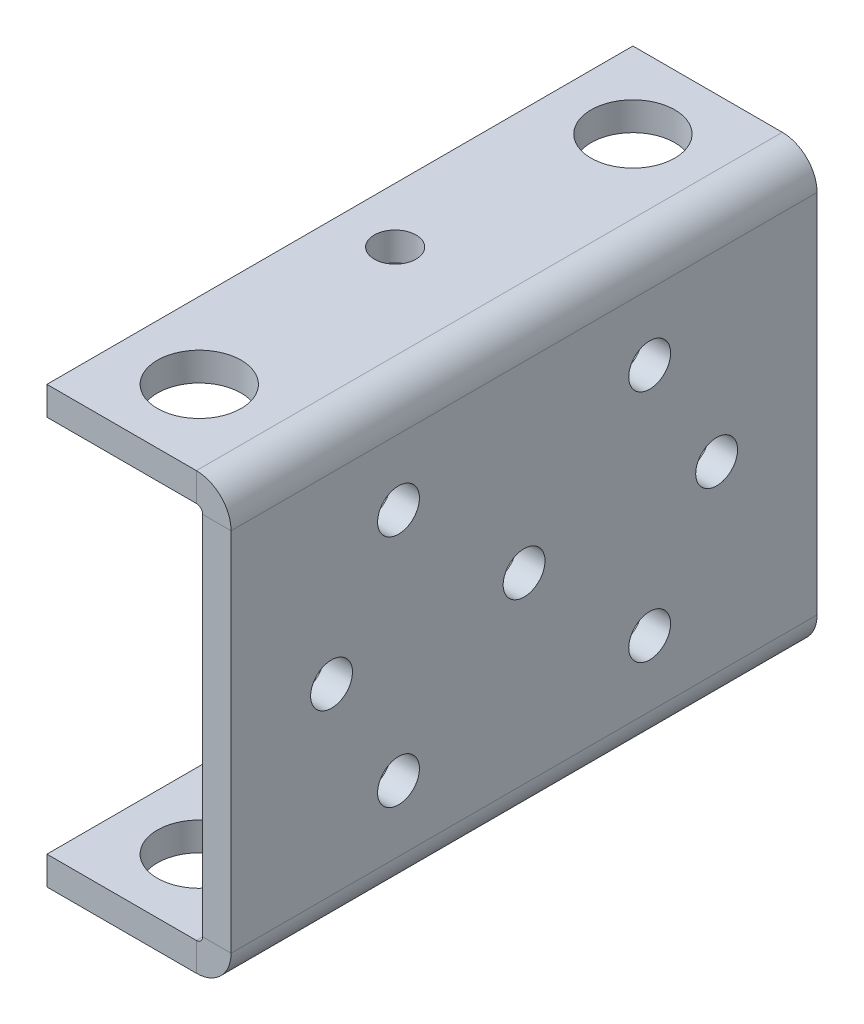
ISO-10303-21;
HEADER;
FILE_DESCRIPTION(('STEP AP214'),'2;1');
FILE_NAME('part.step','',(''),(''),'','','');
FILE_SCHEMA(('AUTOMOTIVE_DESIGN { 1 0 10303 214 1 1 1 1 }'));
ENDSEC;
DATA;
#1=APPLICATION_CONTEXT('core data for automotive mechanical design processes');
#2=APPLICATION_PROTOCOL_DEFINITION('international standard','automotive_design',2000,#1);
#3=PRODUCT_CONTEXT('',#1,'mechanical');
#4=PRODUCT('Part','Part','',(#3));
#5=PRODUCT_RELATED_PRODUCT_CATEGORY('part','',(#4));
#6=PRODUCT_DEFINITION_FORMATION('','',#4);
#7=PRODUCT_DEFINITION_CONTEXT('part definition',#1,'design');
#8=PRODUCT_DEFINITION('design','',#6,#7);
#9=PRODUCT_DEFINITION_SHAPE('','',#8);
#10=(LENGTH_UNIT() NAMED_UNIT(*) SI_UNIT(.MILLI.,.METRE.));
#11=(NAMED_UNIT(*) PLANE_ANGLE_UNIT() SI_UNIT($,.RADIAN.));
#12=(NAMED_UNIT(*) SI_UNIT($,.STERADIAN.) SOLID_ANGLE_UNIT());
#13=UNCERTAINTY_MEASURE_WITH_UNIT(LENGTH_MEASURE(1.E-05),#10,'distance_accuracy_value','');
#14=(GEOMETRIC_REPRESENTATION_CONTEXT(3) GLOBAL_UNCERTAINTY_ASSIGNED_CONTEXT((#13)) GLOBAL_UNIT_ASSIGNED_CONTEXT((#10,
#11,#12)) REPRESENTATION_CONTEXT('',''));
#15=CARTESIAN_POINT('',(0.,0.,0.));
#16=DIRECTION('',(0.,0.,1.));
#17=DIRECTION('',(1.,0.,0.));
#18=AXIS2_PLACEMENT_3D('',#15,#16,#17);
#19=CARTESIAN_POINT('',(-3.40000000000001,26.,70.));
#20=DIRECTION('',(1.,0.,0.));
#21=DIRECTION('',(0.,1.,0.));
#22=AXIS2_PLACEMENT_3D('',#19,#20,#21);
#23=PLANE('',#22);
#24=CARTESIAN_POINT('',(-3.4,-3.21964792834985E-13,34.9999999999981));
#25=DIRECTION('',(-1.,0.,0.));
#26=DIRECTION('',(0.,-1.,0.));
#27=AXIS2_PLACEMENT_3D('',#24,#25,#26);
#28=CIRCLE('',#27,2.50000000000195);
#29=CARTESIAN_POINT('',(-3.4,-2.50000000000228,34.9999999999981));
#30=VERTEX_POINT('',#29);
#31=EDGE_CURVE('E387',#30,#30,#28,.T.);
#32=ORIENTED_EDGE('',*,*,#31,.F.);
#33=EDGE_LOOP('',(#32));
#34=FACE_BOUND('',#33,.T.);
#35=CARTESIAN_POINT('',(-3.40000000000001,13.9999999999997,49.9999999999964));
#36=DIRECTION('',(-1.,0.,0.));
#37=DIRECTION('',(0.,-1.,0.));
#38=AXIS2_PLACEMENT_3D('',#35,#36,#37);
#39=CIRCLE('',#38,2.4999999999999);
#40=CARTESIAN_POINT('',(-3.4,11.4999999999998,49.9999999999964));
#41=VERTEX_POINT('',#40);
#42=EDGE_CURVE('E391',#41,#41,#39,.T.);
#43=ORIENTED_EDGE('',*,*,#42,.F.);
#44=EDGE_LOOP('',(#43));
#45=FACE_BOUND('',#44,.T.);
#46=CARTESIAN_POINT('',(-3.4,-3.20230069359008E-13,57.9999999999981));
#47=DIRECTION('',(-1.,0.,0.));
#48=DIRECTION('',(0.,-1.,0.));
#49=AXIS2_PLACEMENT_3D('',#46,#47,#48);
#50=CIRCLE('',#49,2.50000000000106);
#51=CARTESIAN_POINT('',(-3.4,-2.50000000000138,57.9999999999981));
#52=VERTEX_POINT('',#51);
#53=EDGE_CURVE('E395',#52,#52,#50,.T.);
#54=ORIENTED_EDGE('',*,*,#53,.F.);
#55=EDGE_LOOP('',(#54));
#56=FACE_BOUND('',#55,.T.);
#57=CARTESIAN_POINT('',(-3.4,-14.0000000000003,19.9999999999997));
#58=DIRECTION('',(-1.,0.,0.));
#59=DIRECTION('',(0.,-1.,0.));
#60=AXIS2_PLACEMENT_3D('',#57,#58,#59);
#61=CIRCLE('',#60,2.49999999999998);
#62=CARTESIAN_POINT('',(-3.4,-16.5000000000003,19.9999999999997));
#63=VERTEX_POINT('',#62);
#64=EDGE_CURVE('E398',#63,#63,#61,.T.);
#65=ORIENTED_EDGE('',*,*,#64,.F.);
#66=EDGE_LOOP('',(#65));
#67=FACE_BOUND('',#66,.T.);
#68=DIRECTION('',(0.,0.,1.));
#69=VECTOR('',#68,1.);
#70=CARTESIAN_POINT('',(-3.39999999999999,-21.85,70.));
#71=LINE('',#70,#69);
#72=CARTESIAN_POINT('',(-3.39999999999999,-21.85,70.));
#73=VERTEX_POINT('',#72);
#74=CARTESIAN_POINT('',(-3.39999999999999,-21.85,0.));
#75=VERTEX_POINT('',#74);
#76=EDGE_CURVE('E222',#73,#75,#71,.F.);
#77=ORIENTED_EDGE('',*,*,#76,.F.);
#78=DIRECTION('',(0.,-1.,0.));
#79=VECTOR('',#78,1.);
#80=CARTESIAN_POINT('',(-3.40000000000001,26.,70.));
#81=LINE('',#80,#79);
#82=CARTESIAN_POINT('',(-3.4,21.85,70.));
#83=VERTEX_POINT('',#82);
#84=EDGE_CURVE('E86',#83,#73,#81,.T.);
#85=ORIENTED_EDGE('',*,*,#84,.F.);
#86=DIRECTION('',(0.,0.,-1.));
#87=VECTOR('',#86,1.);
#88=CARTESIAN_POINT('',(-3.4,21.85,0.));
#89=LINE('',#88,#87);
#90=CARTESIAN_POINT('',(-3.4,21.85,0.));
#91=VERTEX_POINT('',#90);
#92=EDGE_CURVE('E273',#91,#83,#89,.F.);
#93=ORIENTED_EDGE('',*,*,#92,.F.);
#94=DIRECTION('',(0.,-1.,0.));
#95=VECTOR('',#94,1.);
#96=CARTESIAN_POINT('',(-3.40000000000001,26.,0.));
#97=LINE('',#96,#95);
#98=EDGE_CURVE('E279',#91,#75,#97,.T.);
#99=ORIENTED_EDGE('',*,*,#98,.T.);
#100=EDGE_LOOP('',(#77,#85,#93,#99));
#101=FACE_BOUND('',#100,.T.);
#102=CARTESIAN_POINT('',(-3.4,-3.23046756997047E-13,11.9999999999981));
#103=DIRECTION('',(1.,0.,0.));
#104=DIRECTION('',(0.,1.,0.));
#105=AXIS2_PLACEMENT_3D('',#102,#103,#104);
#106=CIRCLE('',#105,2.50000000000106);
#107=CARTESIAN_POINT('',(-3.4,2.50000000000074,11.9999999999981));
#108=VERTEX_POINT('',#107);
#109=EDGE_CURVE('E688',#108,#108,#106,.T.);
#110=ORIENTED_EDGE('',*,*,#109,.T.);
#111=EDGE_LOOP('',(#110));
#112=FACE_BOUND('',#111,.T.);
#113=CARTESIAN_POINT('',(-3.4,-14.0000000000003,49.9999999999964));
#114=DIRECTION('',(-1.,0.,0.));
#115=DIRECTION('',(0.,-1.,0.));
#116=AXIS2_PLACEMENT_3D('',#113,#114,#115);
#117=CIRCLE('',#116,2.5);
#118=CARTESIAN_POINT('',(-3.4,-16.5000000000003,49.9999999999964));
#119=VERTEX_POINT('',#118);
#120=EDGE_CURVE('E401',#119,#119,#117,.F.);
#121=ORIENTED_EDGE('',*,*,#120,.T.);
#122=EDGE_LOOP('',(#121));
#123=FACE_BOUND('',#122,.T.);
#124=CARTESIAN_POINT('',(-3.40000000000001,13.9999999999997,19.9999999999997));
#125=DIRECTION('',(1.,0.,0.));
#126=DIRECTION('',(0.,1.,0.));
#127=AXIS2_PLACEMENT_3D('',#124,#125,#126);
#128=CIRCLE('',#127,2.5);
#129=CARTESIAN_POINT('',(-3.40000000000001,16.4999999999997,19.9999999999997));
#130=VERTEX_POINT('',#129);
#131=EDGE_CURVE('E678',#130,#130,#128,.T.);
#132=ORIENTED_EDGE('',*,*,#131,.T.);
#133=EDGE_LOOP('',(#132));
#134=FACE_BOUND('',#133,.T.);
#135=ADVANCED_FACE('F78',(#34,#45,#56,#67,#101,#112,#123,#134),#23,.F.);
#136=CARTESIAN_POINT('',(0.,26.,70.));
#137=DIRECTION('',(1.,0.,0.));
#138=DIRECTION('',(0.,1.,0.));
#139=AXIS2_PLACEMENT_3D('',#136,#137,#138);
#140=PLANE('',#139);
#141=CARTESIAN_POINT('',(0.,-3.20923843055709E-13,34.9999999999981));
#142=DIRECTION('',(-1.,0.,0.));
#143=DIRECTION('',(0.,-1.,0.));
#144=AXIS2_PLACEMENT_3D('',#141,#142,#143);
#145=CIRCLE('',#144,2.50000000000195);
#146=CARTESIAN_POINT('',(0.,-2.50000000000228,34.9999999999981));
#147=VERTEX_POINT('',#146);
#148=EDGE_CURVE('E668',#147,#147,#145,.T.);
#149=ORIENTED_EDGE('',*,*,#148,.T.);
#150=EDGE_LOOP('',(#149));
#151=FACE_BOUND('',#150,.T.);
#152=CARTESIAN_POINT('',(0.,13.9999999999997,49.9999999999964));
#153=DIRECTION('',(-1.,0.,0.));
#154=DIRECTION('',(0.,-1.,0.));
#155=AXIS2_PLACEMENT_3D('',#152,#153,#154);
#156=CIRCLE('',#155,2.4999999999999);
#157=CARTESIAN_POINT('',(0.,11.4999999999998,49.9999999999964));
#158=VERTEX_POINT('',#157);
#159=EDGE_CURVE('E669',#158,#158,#156,.T.);
#160=ORIENTED_EDGE('',*,*,#159,.T.);
#161=EDGE_LOOP('',(#160));
#162=FACE_BOUND('',#161,.T.);
#163=CARTESIAN_POINT('',(0.,-14.0000000000003,49.9999999999964));
#164=DIRECTION('',(-1.,0.,0.));
#165=DIRECTION('',(0.,-1.,0.));
#166=AXIS2_PLACEMENT_3D('',#163,#164,#165);
#167=CIRCLE('',#166,2.5);
#168=CARTESIAN_POINT('',(0.,-16.5000000000003,49.9999999999964));
#169=VERTEX_POINT('',#168);
#170=EDGE_CURVE('E407',#169,#169,#167,.F.);
#171=ORIENTED_EDGE('',*,*,#170,.F.);
#172=EDGE_LOOP('',(#171));
#173=FACE_BOUND('',#172,.T.);
#174=CARTESIAN_POINT('',(0.,-3.19189119579732E-13,57.9999999999981));
#175=DIRECTION('',(-1.,0.,0.));
#176=DIRECTION('',(0.,-1.,0.));
#177=AXIS2_PLACEMENT_3D('',#174,#175,#176);
#178=CIRCLE('',#177,2.50000000000106);
#179=CARTESIAN_POINT('',(0.,-2.50000000000138,57.9999999999981));
#180=VERTEX_POINT('',#179);
#181=EDGE_CURVE('E691',#180,#180,#178,.T.);
#182=ORIENTED_EDGE('',*,*,#181,.T.);
#183=EDGE_LOOP('',(#182));
#184=FACE_BOUND('',#183,.T.);
#185=DIRECTION('',(0.,-1.,0.));
#186=VECTOR('',#185,1.);
#187=CARTESIAN_POINT('',(0.,26.,70.));
#188=LINE('',#187,#186);
#189=CARTESIAN_POINT('',(0.,21.85,70.));
#190=VERTEX_POINT('',#189);
#191=CARTESIAN_POINT('',(0.,-21.85,70.));
#192=VERTEX_POINT('',#191);
#193=EDGE_CURVE('E13',#190,#192,#188,.T.);
#194=ORIENTED_EDGE('',*,*,#193,.T.);
#195=DIRECTION('',(0.,0.,1.));
#196=VECTOR('',#195,1.);
#197=CARTESIAN_POINT('',(0.,-21.85,70.));
#198=LINE('',#197,#196);
#199=CARTESIAN_POINT('',(0.,-21.85,0.));
#200=VERTEX_POINT('',#199);
#201=EDGE_CURVE('E211',#192,#200,#198,.F.);
#202=ORIENTED_EDGE('',*,*,#201,.T.);
#203=DIRECTION('',(0.,-1.,0.));
#204=VECTOR('',#203,1.);
#205=CARTESIAN_POINT('',(0.,26.,0.));
#206=LINE('',#205,#204);
#207=CARTESIAN_POINT('',(0.,21.85,0.));
#208=VERTEX_POINT('',#207);
#209=EDGE_CURVE('E283',#208,#200,#206,.T.);
#210=ORIENTED_EDGE('',*,*,#209,.F.);
#211=DIRECTION('',(0.,0.,-1.));
#212=VECTOR('',#211,1.);
#213=CARTESIAN_POINT('',(0.,21.85,0.));
#214=LINE('',#213,#212);
#215=EDGE_CURVE('E262',#208,#190,#214,.F.);
#216=ORIENTED_EDGE('',*,*,#215,.T.);
#217=EDGE_LOOP('',(#194,#202,#210,#216));
#218=FACE_BOUND('',#217,.T.);
#219=CARTESIAN_POINT('',(0.,-14.0000000000003,19.9999999999997));
#220=DIRECTION('',(-1.,0.,0.));
#221=DIRECTION('',(0.,-1.,0.));
#222=AXIS2_PLACEMENT_3D('',#219,#220,#221);
#223=CIRCLE('',#222,2.49999999999998);
#224=CARTESIAN_POINT('',(0.,-16.5000000000003,19.9999999999997));
#225=VERTEX_POINT('',#224);
#226=EDGE_CURVE('E400',#225,#225,#223,.T.);
#227=ORIENTED_EDGE('',*,*,#226,.T.);
#228=EDGE_LOOP('',(#227));
#229=FACE_BOUND('',#228,.T.);
#230=CARTESIAN_POINT('',(0.,-3.22005807217771E-13,11.9999999999981));
#231=DIRECTION('',(1.,0.,0.));
#232=DIRECTION('',(0.,1.,0.));
#233=AXIS2_PLACEMENT_3D('',#230,#231,#232);
#234=CIRCLE('',#233,2.50000000000106);
#235=CARTESIAN_POINT('',(0.,2.50000000000074,11.9999999999981));
#236=VERTEX_POINT('',#235);
#237=EDGE_CURVE('E685',#236,#236,#234,.T.);
#238=ORIENTED_EDGE('',*,*,#237,.F.);
#239=EDGE_LOOP('',(#238));
#240=FACE_BOUND('',#239,.T.);
#241=CARTESIAN_POINT('',(0.,13.9999999999997,19.9999999999997));
#242=DIRECTION('',(1.,0.,0.));
#243=DIRECTION('',(0.,1.,0.));
#244=AXIS2_PLACEMENT_3D('',#241,#242,#243);
#245=CIRCLE('',#244,2.5);
#246=CARTESIAN_POINT('',(0.,16.4999999999997,19.9999999999997));
#247=VERTEX_POINT('',#246);
#248=EDGE_CURVE('E680',#247,#247,#245,.T.);
#249=ORIENTED_EDGE('',*,*,#248,.F.);
#250=EDGE_LOOP('',(#249));
#251=FACE_BOUND('',#250,.T.);
#252=ADVANCED_FACE('F328',(#151,#162,#173,#184,#218,#229,#240,#251),#140,.T.);
#253=CARTESIAN_POINT('',(0.,0.,70.));
#254=DIRECTION('',(0.,0.,-1.));
#255=DIRECTION('',(-1.,0.,0.));
#256=AXIS2_PLACEMENT_3D('',#253,#254,#255);
#257=PLANE('',#256);
#258=DIRECTION('',(1.,0.,0.));
#259=VECTOR('',#258,1.);
#260=CARTESIAN_POINT('',(-3.39999999999999,-21.85,70.));
#261=LINE('',#260,#259);
#262=EDGE_CURVE('E216',#73,#192,#261,.T.);
#263=ORIENTED_EDGE('',*,*,#262,.T.);
#264=ORIENTED_EDGE('',*,*,#193,.F.);
#265=DIRECTION('',(1.,0.,0.));
#266=VECTOR('',#265,1.);
#267=CARTESIAN_POINT('',(-3.4,21.85,70.));
#268=LINE('',#267,#266);
#269=EDGE_CURVE('E277',#83,#190,#268,.T.);
#270=ORIENTED_EDGE('',*,*,#269,.F.);
#271=ORIENTED_EDGE('',*,*,#84,.T.);
#272=EDGE_LOOP('',(#263,#264,#270,#271));
#273=FACE_BOUND('',#272,.T.);
#274=ADVANCED_FACE('F324',(#273),#257,.F.);
#275=CARTESIAN_POINT('',(0.,0.,0.));
#276=DIRECTION('',(0.,0.,-1.));
#277=DIRECTION('',(-1.,0.,0.));
#278=AXIS2_PLACEMENT_3D('',#275,#276,#277);
#279=PLANE('',#278);
#280=DIRECTION('',(1.,0.,0.));
#281=VECTOR('',#280,1.);
#282=CARTESIAN_POINT('',(-3.39999999999999,-21.85,0.));
#283=LINE('',#282,#281);
#284=EDGE_CURVE('E227',#75,#200,#283,.T.);
#285=ORIENTED_EDGE('',*,*,#284,.F.);
#286=ORIENTED_EDGE('',*,*,#98,.F.);
#287=DIRECTION('',(1.,0.,0.));
#288=VECTOR('',#287,1.);
#289=CARTESIAN_POINT('',(-3.4,21.85,0.));
#290=LINE('',#289,#288);
#291=EDGE_CURVE('E267',#91,#208,#290,.T.);
#292=ORIENTED_EDGE('',*,*,#291,.T.);
#293=ORIENTED_EDGE('',*,*,#209,.T.);
#294=EDGE_LOOP('',(#285,#286,#292,#293));
#295=FACE_BOUND('',#294,.T.);
#296=ADVANCED_FACE('F340',(#295),#279,.T.);
#297=CARTESIAN_POINT('',(-4.15,21.85,70.));
#298=DIRECTION('',(0.,0.,1.));
#299=DIRECTION('',(1.,0.,0.));
#300=AXIS2_PLACEMENT_3D('',#297,#298,#299);
#301=PLANE('',#300);
#302=DIRECTION('',(0.,-1.,0.));
#303=VECTOR('',#302,1.);
#304=CARTESIAN_POINT('',(-4.14999999999999,26.,70.));
#305=LINE('',#304,#303);
#306=CARTESIAN_POINT('',(-4.15,22.6,70.));
#307=VERTEX_POINT('',#306);
#308=CARTESIAN_POINT('',(-4.14999999999999,26.,70.));
#309=VERTEX_POINT('',#308);
#310=EDGE_CURVE('E229',#307,#309,#305,.F.);
#311=ORIENTED_EDGE('',*,*,#310,.F.);
#312=CARTESIAN_POINT('',(-4.15,21.85,70.));
#313=DIRECTION('',(0.,0.,-1.));
#314=DIRECTION('',(-1.,0.,0.));
#315=AXIS2_PLACEMENT_3D('',#312,#313,#314);
#316=CIRCLE('',#315,0.750000000000001);
#317=EDGE_CURVE('E270',#83,#307,#316,.F.);
#318=ORIENTED_EDGE('',*,*,#317,.F.);
#319=ORIENTED_EDGE('',*,*,#269,.T.);
#320=CARTESIAN_POINT('',(-4.15,21.85,70.));
#321=DIRECTION('',(0.,0.,-1.));
#322=DIRECTION('',(-1.,0.,0.));
#323=AXIS2_PLACEMENT_3D('',#320,#321,#322);
#324=CIRCLE('',#323,4.15);
#325=EDGE_CURVE('E94',#190,#309,#324,.F.);
#326=ORIENTED_EDGE('',*,*,#325,.T.);
#327=EDGE_LOOP('',(#311,#318,#319,#326));
#328=FACE_BOUND('',#327,.T.);
#329=ADVANCED_FACE('F349',(#328),#301,.T.);
#330=CARTESIAN_POINT('',(-4.15,21.85,0.));
#331=DIRECTION('',(0.,0.,1.));
#332=DIRECTION('',(1.,0.,0.));
#333=AXIS2_PLACEMENT_3D('',#330,#331,#332);
#334=PLANE('',#333);
#335=CARTESIAN_POINT('',(-4.15,21.85,0.));
#336=DIRECTION('',(0.,0.,-1.));
#337=DIRECTION('',(-1.,0.,0.));
#338=AXIS2_PLACEMENT_3D('',#335,#336,#337);
#339=CIRCLE('',#338,0.750000000000001);
#340=CARTESIAN_POINT('',(-4.15,22.6,0.));
#341=VERTEX_POINT('',#340);
#342=EDGE_CURVE('E235',#341,#91,#339,.T.);
#343=ORIENTED_EDGE('',*,*,#342,.F.);
#344=DIRECTION('',(0.,-1.,0.));
#345=VECTOR('',#344,1.);
#346=CARTESIAN_POINT('',(-4.15,22.6,0.));
#347=LINE('',#346,#345);
#348=CARTESIAN_POINT('',(-4.14999999999999,26.,0.));
#349=VERTEX_POINT('',#348);
#350=EDGE_CURVE('E255',#341,#349,#347,.F.);
#351=ORIENTED_EDGE('',*,*,#350,.T.);
#352=CARTESIAN_POINT('',(-4.15,21.85,0.));
#353=DIRECTION('',(0.,0.,-1.));
#354=DIRECTION('',(-1.,0.,0.));
#355=AXIS2_PLACEMENT_3D('',#352,#353,#354);
#356=CIRCLE('',#355,4.15);
#357=EDGE_CURVE('E265',#349,#208,#356,.T.);
#358=ORIENTED_EDGE('',*,*,#357,.T.);
#359=ORIENTED_EDGE('',*,*,#291,.F.);
#360=EDGE_LOOP('',(#343,#351,#358,#359));
#361=FACE_BOUND('',#360,.T.);
#362=ADVANCED_FACE('F334',(#361),#334,.F.);
#363=CARTESIAN_POINT('',(-4.15,21.85,0.));
#364=DIRECTION('',(0.,0.,-1.));
#365=DIRECTION('',(0.,1.,0.));
#366=AXIS2_PLACEMENT_3D('',#363,#364,#365);
#367=CYLINDRICAL_SURFACE('',#366,4.15);
#368=ORIENTED_EDGE('',*,*,#215,.F.);
#369=ORIENTED_EDGE('',*,*,#357,.F.);
#370=DIRECTION('',(0.,0.,-1.));
#371=VECTOR('',#370,1.);
#372=CARTESIAN_POINT('',(-4.14999999999999,26.,70.));
#373=LINE('',#372,#371);
#374=EDGE_CURVE('E253',#349,#309,#373,.F.);
#375=ORIENTED_EDGE('',*,*,#374,.T.);
#376=ORIENTED_EDGE('',*,*,#325,.F.);
#377=EDGE_LOOP('',(#368,#369,#375,#376));
#378=FACE_BOUND('',#377,.T.);
#379=ADVANCED_FACE('F331',(#378),#367,.T.);
#380=CARTESIAN_POINT('',(-4.15,21.85,0.));
#381=DIRECTION('',(0.,0.,-1.));
#382=DIRECTION('',(0.,1.,0.));
#383=AXIS2_PLACEMENT_3D('',#380,#381,#382);
#384=CYLINDRICAL_SURFACE('',#383,0.750000000000001);
#385=ORIENTED_EDGE('',*,*,#92,.T.);
#386=ORIENTED_EDGE('',*,*,#317,.T.);
#387=DIRECTION('',(0.,0.,-1.));
#388=VECTOR('',#387,1.);
#389=CARTESIAN_POINT('',(-4.15,22.6,70.));
#390=LINE('',#389,#388);
#391=EDGE_CURVE('E258',#307,#341,#390,.T.);
#392=ORIENTED_EDGE('',*,*,#391,.T.);
#393=ORIENTED_EDGE('',*,*,#342,.T.);
#394=EDGE_LOOP('',(#385,#386,#392,#393));
#395=FACE_BOUND('',#394,.T.);
#396=ADVANCED_FACE('F346',(#395),#384,.F.);
#397=CARTESIAN_POINT('',(-3.4,26.,70.));
#398=DIRECTION('',(0.,0.,-1.));
#399=DIRECTION('',(-1.,0.,0.));
#400=AXIS2_PLACEMENT_3D('',#397,#398,#399);
#401=PLANE('',#400);
#402=ORIENTED_EDGE('',*,*,#310,.T.);
#403=DIRECTION('',(1.,0.,0.));
#404=VECTOR('',#403,1.);
#405=CARTESIAN_POINT('',(0.,26.,70.));
#406=LINE('',#405,#404);
#407=CARTESIAN_POINT('',(-22.,26.0000000000001,70.));
#408=VERTEX_POINT('',#407);
#409=EDGE_CURVE('E243',#408,#309,#406,.T.);
#410=ORIENTED_EDGE('',*,*,#409,.F.);
#411=DIRECTION('',(0.,-1.,0.));
#412=VECTOR('',#411,1.);
#413=CARTESIAN_POINT('',(-22.,26.0000000000001,70.));
#414=LINE('',#413,#412);
#415=CARTESIAN_POINT('',(-22.,22.6000000000001,70.));
#416=VERTEX_POINT('',#415);
#417=EDGE_CURVE('E236',#408,#416,#414,.T.);
#418=ORIENTED_EDGE('',*,*,#417,.T.);
#419=DIRECTION('',(-1.,0.,0.));
#420=VECTOR('',#419,1.);
#421=CARTESIAN_POINT('',(-3.40000000000001,22.6,70.));
#422=LINE('',#421,#420);
#423=EDGE_CURVE('E250',#416,#307,#422,.F.);
#424=ORIENTED_EDGE('',*,*,#423,.T.);
#425=EDGE_LOOP('',(#402,#410,#418,#424));
#426=FACE_BOUND('',#425,.T.);
#427=ADVANCED_FACE('F352',(#426),#401,.F.);
#428=CARTESIAN_POINT('',(-22.,26.0000000000001,0.));
#429=DIRECTION('',(0.,0.,1.));
#430=DIRECTION('',(1.,0.,0.));
#431=AXIS2_PLACEMENT_3D('',#428,#429,#430);
#432=PLANE('',#431);
#433=ORIENTED_EDGE('',*,*,#350,.F.);
#434=DIRECTION('',(1.,0.,0.));
#435=VECTOR('',#434,1.);
#436=CARTESIAN_POINT('',(-22.,22.6000000000001,0.));
#437=LINE('',#436,#435);
#438=CARTESIAN_POINT('',(-22.,22.6000000000001,0.));
#439=VERTEX_POINT('',#438);
#440=EDGE_CURVE('E248',#341,#439,#437,.F.);
#441=ORIENTED_EDGE('',*,*,#440,.T.);
#442=DIRECTION('',(0.,-1.,0.));
#443=VECTOR('',#442,1.);
#444=CARTESIAN_POINT('',(-22.,26.0000000000001,0.));
#445=LINE('',#444,#443);
#446=CARTESIAN_POINT('',(-22.,26.0000000000001,0.));
#447=VERTEX_POINT('',#446);
#448=EDGE_CURVE('E232',#447,#439,#445,.T.);
#449=ORIENTED_EDGE('',*,*,#448,.F.);
#450=DIRECTION('',(-1.,0.,0.));
#451=VECTOR('',#450,1.);
#452=CARTESIAN_POINT('',(0.,26.,0.));
#453=LINE('',#452,#451);
#454=EDGE_CURVE('E241',#349,#447,#453,.T.);
#455=ORIENTED_EDGE('',*,*,#454,.F.);
#456=EDGE_LOOP('',(#433,#441,#449,#455));
#457=FACE_BOUND('',#456,.T.);
#458=ADVANCED_FACE('F367',(#457),#432,.F.);
#459=CARTESIAN_POINT('',(0.,26.,0.));
#460=DIRECTION('',(0.,-1.,0.));
#461=DIRECTION('',(1.,0.,0.));
#462=AXIS2_PLACEMENT_3D('',#459,#460,#461);
#463=PLANE('',#462);
#464=CARTESIAN_POINT('',(-12.9000000000004,26.0000000000001,60.9));
#465=DIRECTION('',(0.,-1.,0.));
#466=DIRECTION('',(-1.,0.,0.));
#467=AXIS2_PLACEMENT_3D('',#464,#465,#466);
#468=CIRCLE('',#467,5.);
#469=CARTESIAN_POINT('',(-17.9000000000004,26.0000000000001,60.9));
#470=VERTEX_POINT('',#469);
#471=EDGE_CURVE('E415',#470,#470,#468,.T.);
#472=ORIENTED_EDGE('',*,*,#471,.T.);
#473=EDGE_LOOP('',(#472));
#474=FACE_BOUND('',#473,.T.);
#475=CARTESIAN_POINT('',(-12.9,26.0000000000001,9.1));
#476=DIRECTION('',(0.,-1.,0.));
#477=DIRECTION('',(1.,0.,0.));
#478=AXIS2_PLACEMENT_3D('',#475,#476,#477);
#479=CIRCLE('',#478,5.);
#480=CARTESIAN_POINT('',(-7.9,26.0000000000001,9.1));
#481=VERTEX_POINT('',#480);
#482=EDGE_CURVE('E414',#481,#481,#479,.T.);
#483=ORIENTED_EDGE('',*,*,#482,.T.);
#484=EDGE_LOOP('',(#483));
#485=FACE_BOUND('',#484,.T.);
#486=CARTESIAN_POINT('',(-15.4,26.0000000000001,35.));
#487=DIRECTION('',(0.,-1.,0.));
#488=DIRECTION('',(1.,0.,0.));
#489=AXIS2_PLACEMENT_3D('',#486,#487,#488);
#490=CIRCLE('',#489,2.5);
#491=CARTESIAN_POINT('',(-12.9,26.0000000000001,35.));
#492=VERTEX_POINT('',#491);
#493=EDGE_CURVE('E292',#492,#492,#490,.T.);
#494=ORIENTED_EDGE('',*,*,#493,.T.);
#495=EDGE_LOOP('',(#494));
#496=FACE_BOUND('',#495,.T.);
#497=ORIENTED_EDGE('',*,*,#374,.F.);
#498=ORIENTED_EDGE('',*,*,#454,.T.);
#499=DIRECTION('',(0.,0.,1.));
#500=VECTOR('',#499,1.);
#501=CARTESIAN_POINT('',(-22.,26.0000000000001,0.));
#502=LINE('',#501,#500);
#503=EDGE_CURVE('E239',#447,#408,#502,.T.);
#504=ORIENTED_EDGE('',*,*,#503,.T.);
#505=ORIENTED_EDGE('',*,*,#409,.T.);
#506=EDGE_LOOP('',(#497,#498,#504,#505));
#507=FACE_BOUND('',#506,.T.);
#508=ADVANCED_FACE('F355',(#474,#485,#496,#507),#463,.F.);
#509=CARTESIAN_POINT('',(0.,22.6,0.));
#510=DIRECTION('',(0.,-1.,0.));
#511=DIRECTION('',(1.,0.,0.));
#512=AXIS2_PLACEMENT_3D('',#509,#510,#511);
#513=PLANE('',#512);
#514=CARTESIAN_POINT('',(-12.9000000000004,22.6,60.9));
#515=DIRECTION('',(0.,-1.,0.));
#516=DIRECTION('',(1.,0.,0.));
#517=AXIS2_PLACEMENT_3D('',#514,#515,#516);
#518=CIRCLE('',#517,5.);
#519=CARTESIAN_POINT('',(-7.90000000000043,22.6,60.9));
#520=VERTEX_POINT('',#519);
#521=EDGE_CURVE('E210',#520,#520,#518,.T.);
#522=ORIENTED_EDGE('',*,*,#521,.F.);
#523=EDGE_LOOP('',(#522));
#524=FACE_BOUND('',#523,.T.);
#525=CARTESIAN_POINT('',(-12.9,22.6,9.1));
#526=DIRECTION('',(0.,-1.,0.));
#527=DIRECTION('',(1.,0.,0.));
#528=AXIS2_PLACEMENT_3D('',#525,#526,#527);
#529=CIRCLE('',#528,5.);
#530=CARTESIAN_POINT('',(-7.90000000000001,22.6,9.1));
#531=VERTEX_POINT('',#530);
#532=EDGE_CURVE('E295',#531,#531,#529,.T.);
#533=ORIENTED_EDGE('',*,*,#532,.F.);
#534=EDGE_LOOP('',(#533));
#535=FACE_BOUND('',#534,.T.);
#536=CARTESIAN_POINT('',(-15.4,22.6,35.));
#537=DIRECTION('',(0.,-1.,0.));
#538=DIRECTION('',(1.,0.,0.));
#539=AXIS2_PLACEMENT_3D('',#536,#537,#538);
#540=CIRCLE('',#539,2.5);
#541=CARTESIAN_POINT('',(-12.9,22.6,35.));
#542=VERTEX_POINT('',#541);
#543=EDGE_CURVE('E291',#542,#542,#540,.T.);
#544=ORIENTED_EDGE('',*,*,#543,.F.);
#545=EDGE_LOOP('',(#544));
#546=FACE_BOUND('',#545,.T.);
#547=ORIENTED_EDGE('',*,*,#440,.F.);
#548=ORIENTED_EDGE('',*,*,#391,.F.);
#549=ORIENTED_EDGE('',*,*,#423,.F.);
#550=DIRECTION('',(0.,0.,-1.));
#551=VECTOR('',#550,1.);
#552=CARTESIAN_POINT('',(-22.,22.6000000000001,70.));
#553=LINE('',#552,#551);
#554=EDGE_CURVE('E246',#439,#416,#553,.F.);
#555=ORIENTED_EDGE('',*,*,#554,.F.);
#556=EDGE_LOOP('',(#547,#548,#549,#555));
#557=FACE_BOUND('',#556,.T.);
#558=ADVANCED_FACE('F365',(#524,#535,#546,#557),#513,.T.);
#559=CARTESIAN_POINT('',(-22.,26.0000000000001,70.));
#560=DIRECTION('',(1.,0.,0.));
#561=DIRECTION('',(0.,1.,0.));
#562=AXIS2_PLACEMENT_3D('',#559,#560,#561);
#563=PLANE('',#562);
#564=ORIENTED_EDGE('',*,*,#554,.T.);
#565=ORIENTED_EDGE('',*,*,#417,.F.);
#566=ORIENTED_EDGE('',*,*,#503,.F.);
#567=ORIENTED_EDGE('',*,*,#448,.T.);
#568=EDGE_LOOP('',(#564,#565,#566,#567));
#569=FACE_BOUND('',#568,.T.);
#570=ADVANCED_FACE('F361',(#569),#563,.F.);
#571=CARTESIAN_POINT('',(-4.14999999999999,-21.85,0.));
#572=DIRECTION('',(0.,0.,-1.));
#573=DIRECTION('',(-1.,0.,0.));
#574=AXIS2_PLACEMENT_3D('',#571,#572,#573);
#575=PLANE('',#574);
#576=DIRECTION('',(0.,1.,0.));
#577=VECTOR('',#576,1.);
#578=CARTESIAN_POINT('',(-4.14999999999998,-26.,0.));
#579=LINE('',#578,#577);
#580=CARTESIAN_POINT('',(-4.14999999999999,-22.6,0.));
#581=VERTEX_POINT('',#580);
#582=CARTESIAN_POINT('',(-4.14999999999998,-26.,0.));
#583=VERTEX_POINT('',#582);
#584=EDGE_CURVE('E192',#581,#583,#579,.F.);
#585=ORIENTED_EDGE('',*,*,#584,.F.);
#586=CARTESIAN_POINT('',(-4.14999999999999,-21.85,0.));
#587=DIRECTION('',(0.,0.,1.));
#588=DIRECTION('',(1.,0.,0.));
#589=AXIS2_PLACEMENT_3D('',#586,#587,#588);
#590=CIRCLE('',#589,0.750000000000001);
#591=EDGE_CURVE('E219',#75,#581,#590,.F.);
#592=ORIENTED_EDGE('',*,*,#591,.F.);
#593=ORIENTED_EDGE('',*,*,#284,.T.);
#594=CARTESIAN_POINT('',(-4.14999999999999,-21.85,0.));
#595=DIRECTION('',(0.,0.,1.));
#596=DIRECTION('',(1.,0.,0.));
#597=AXIS2_PLACEMENT_3D('',#594,#595,#596);
#598=CIRCLE('',#597,4.15);
#599=EDGE_CURVE('E102',#200,#583,#598,.F.);
#600=ORIENTED_EDGE('',*,*,#599,.T.);
#601=EDGE_LOOP('',(#585,#592,#593,#600));
#602=FACE_BOUND('',#601,.T.);
#603=ADVANCED_FACE('F474',(#602),#575,.T.);
#604=CARTESIAN_POINT('',(-4.14999999999999,-21.85,70.));
#605=DIRECTION('',(0.,0.,-1.));
#606=DIRECTION('',(-1.,0.,0.));
#607=AXIS2_PLACEMENT_3D('',#604,#605,#606);
#608=PLANE('',#607);
#609=CARTESIAN_POINT('',(-4.14999999999999,-21.85,70.));
#610=DIRECTION('',(0.,0.,1.));
#611=DIRECTION('',(1.,0.,0.));
#612=AXIS2_PLACEMENT_3D('',#609,#610,#611);
#613=CIRCLE('',#612,0.750000000000001);
#614=CARTESIAN_POINT('',(-4.14999999999999,-22.6,70.));
#615=VERTEX_POINT('',#614);
#616=EDGE_CURVE('E224',#615,#73,#613,.T.);
#617=ORIENTED_EDGE('',*,*,#616,.F.);
#618=DIRECTION('',(0.,1.,0.));
#619=VECTOR('',#618,1.);
#620=CARTESIAN_POINT('',(-4.14999999999999,-22.6,70.));
#621=LINE('',#620,#619);
#622=CARTESIAN_POINT('',(-4.14999999999998,-26.,70.));
#623=VERTEX_POINT('',#622);
#624=EDGE_CURVE('E204',#615,#623,#621,.F.);
#625=ORIENTED_EDGE('',*,*,#624,.T.);
#626=CARTESIAN_POINT('',(-4.14999999999999,-21.85,70.));
#627=DIRECTION('',(0.,0.,1.));
#628=DIRECTION('',(1.,0.,0.));
#629=AXIS2_PLACEMENT_3D('',#626,#627,#628);
#630=CIRCLE('',#629,4.15);
#631=EDGE_CURVE('E214',#623,#192,#630,.T.);
#632=ORIENTED_EDGE('',*,*,#631,.T.);
#633=ORIENTED_EDGE('',*,*,#262,.F.);
#634=EDGE_LOOP('',(#617,#625,#632,#633));
#635=FACE_BOUND('',#634,.T.);
#636=ADVANCED_FACE('F321',(#635),#608,.F.);
#637=CARTESIAN_POINT('',(-4.14999999999999,-21.85,70.));
#638=DIRECTION('',(0.,0.,1.));
#639=DIRECTION('',(0.,-1.,0.));
#640=AXIS2_PLACEMENT_3D('',#637,#638,#639);
#641=CYLINDRICAL_SURFACE('',#640,4.15);
#642=ORIENTED_EDGE('',*,*,#201,.F.);
#643=ORIENTED_EDGE('',*,*,#631,.F.);
#644=DIRECTION('',(0.,0.,1.));
#645=VECTOR('',#644,1.);
#646=CARTESIAN_POINT('',(-4.14999999999998,-26.,0.));
#647=LINE('',#646,#645);
#648=EDGE_CURVE('E202',#623,#583,#647,.F.);
#649=ORIENTED_EDGE('',*,*,#648,.T.);
#650=ORIENTED_EDGE('',*,*,#599,.F.);
#651=EDGE_LOOP('',(#642,#643,#649,#650));
#652=FACE_BOUND('',#651,.T.);
#653=ADVANCED_FACE('F469',(#652),#641,.T.);
#654=CARTESIAN_POINT('',(-4.14999999999999,-21.85,70.));
#655=DIRECTION('',(0.,0.,1.));
#656=DIRECTION('',(0.,-1.,0.));
#657=AXIS2_PLACEMENT_3D('',#654,#655,#656);
#658=CYLINDRICAL_SURFACE('',#657,0.750000000000001);
#659=ORIENTED_EDGE('',*,*,#76,.T.);
#660=ORIENTED_EDGE('',*,*,#591,.T.);
#661=DIRECTION('',(0.,0.,1.));
#662=VECTOR('',#661,1.);
#663=CARTESIAN_POINT('',(-4.14999999999999,-22.6,0.));
#664=LINE('',#663,#662);
#665=EDGE_CURVE('E207',#581,#615,#664,.T.);
#666=ORIENTED_EDGE('',*,*,#665,.T.);
#667=ORIENTED_EDGE('',*,*,#616,.T.);
#668=EDGE_LOOP('',(#659,#660,#666,#667));
#669=FACE_BOUND('',#668,.T.);
#670=ADVANCED_FACE('F317',(#669),#658,.F.);
#671=CARTESIAN_POINT('',(-22.,-26.0000000000001,70.));
#672=DIRECTION('',(0.,0.,-1.));
#673=DIRECTION('',(-1.,0.,0.));
#674=AXIS2_PLACEMENT_3D('',#671,#672,#673);
#675=PLANE('',#674);
#676=ORIENTED_EDGE('',*,*,#624,.F.);
#677=DIRECTION('',(1.,0.,0.));
#678=VECTOR('',#677,1.);
#679=CARTESIAN_POINT('',(-22.,-22.6000000000001,70.));
#680=LINE('',#679,#678);
#681=CARTESIAN_POINT('',(-22.,-22.6000000000001,70.));
#682=VERTEX_POINT('',#681);
#683=EDGE_CURVE('E200',#615,#682,#680,.F.);
#684=ORIENTED_EDGE('',*,*,#683,.T.);
#685=DIRECTION('',(0.,1.,0.));
#686=VECTOR('',#685,1.);
#687=CARTESIAN_POINT('',(-22.,-26.0000000000001,70.));
#688=LINE('',#687,#686);
#689=CARTESIAN_POINT('',(-22.,-26.0000000000001,70.));
#690=VERTEX_POINT('',#689);
#691=EDGE_CURVE('E188',#690,#682,#688,.T.);
#692=ORIENTED_EDGE('',*,*,#691,.F.);
#693=DIRECTION('',(-1.,0.,0.));
#694=VECTOR('',#693,1.);
#695=CARTESIAN_POINT('',(1.08866327681953E-13,-26.,70.));
#696=LINE('',#695,#694);
#697=EDGE_CURVE('E175',#623,#690,#696,.T.);
#698=ORIENTED_EDGE('',*,*,#697,.F.);
#699=EDGE_LOOP('',(#676,#684,#692,#698));
#700=FACE_BOUND('',#699,.T.);
#701=ADVANCED_FACE('F310',(#700),#675,.F.);
#702=CARTESIAN_POINT('',(-3.39999999999998,-26.,0.));
#703=DIRECTION('',(0.,0.,1.));
#704=DIRECTION('',(1.,0.,0.));
#705=AXIS2_PLACEMENT_3D('',#702,#703,#704);
#706=PLANE('',#705);
#707=ORIENTED_EDGE('',*,*,#584,.T.);
#708=DIRECTION('',(1.,0.,0.));
#709=VECTOR('',#708,1.);
#710=CARTESIAN_POINT('',(1.08866327681953E-13,-26.,0.));
#711=LINE('',#710,#709);
#712=CARTESIAN_POINT('',(-22.,-26.0000000000001,0.));
#713=VERTEX_POINT('',#712);
#714=EDGE_CURVE('E173',#713,#583,#711,.T.);
#715=ORIENTED_EDGE('',*,*,#714,.F.);
#716=DIRECTION('',(0.,1.,0.));
#717=VECTOR('',#716,1.);
#718=CARTESIAN_POINT('',(-22.,-26.0000000000001,0.));
#719=LINE('',#718,#717);
#720=CARTESIAN_POINT('',(-22.,-22.6000000000001,0.));
#721=VERTEX_POINT('',#720);
#722=EDGE_CURVE('E181',#713,#721,#719,.T.);
#723=ORIENTED_EDGE('',*,*,#722,.T.);
#724=DIRECTION('',(-1.,0.,0.));
#725=VECTOR('',#724,1.);
#726=CARTESIAN_POINT('',(-3.39999999999999,-22.6,0.));
#727=LINE('',#726,#725);
#728=EDGE_CURVE('E197',#721,#581,#727,.F.);
#729=ORIENTED_EDGE('',*,*,#728,.T.);
#730=EDGE_LOOP('',(#707,#715,#723,#729));
#731=FACE_BOUND('',#730,.T.);
#732=ADVANCED_FACE('F191',(#731),#706,.F.);
#733=CARTESIAN_POINT('',(1.08866327681953E-13,-26.,0.));
#734=DIRECTION('',(0.,1.,0.));
#735=DIRECTION('',(-1.,0.,0.));
#736=AXIS2_PLACEMENT_3D('',#733,#734,#735);
#737=PLANE('',#736);
#738=CARTESIAN_POINT('',(-12.9000000000006,-26.0000000000001,60.9));
#739=DIRECTION('',(0.,-1.,0.));
#740=DIRECTION('',(-1.,0.,0.));
#741=AXIS2_PLACEMENT_3D('',#738,#739,#740);
#742=CIRCLE('',#741,5.);
#743=CARTESIAN_POINT('',(-17.9000000000006,-26.0000000000001,60.9));
#744=VERTEX_POINT('',#743);
#745=EDGE_CURVE('E404',#744,#744,#742,.T.);
#746=ORIENTED_EDGE('',*,*,#745,.F.);
#747=EDGE_LOOP('',(#746));
#748=FACE_BOUND('',#747,.T.);
#749=CARTESIAN_POINT('',(-12.9000000000002,-26.0000000000001,9.1));
#750=DIRECTION('',(0.,-1.,0.));
#751=DIRECTION('',(1.,0.,0.));
#752=AXIS2_PLACEMENT_3D('',#749,#750,#751);
#753=CIRCLE('',#752,5.);
#754=CARTESIAN_POINT('',(-7.90000000000017,-26.0000000000001,9.1));
#755=VERTEX_POINT('',#754);
#756=EDGE_CURVE('E411',#755,#755,#753,.T.);
#757=ORIENTED_EDGE('',*,*,#756,.F.);
#758=EDGE_LOOP('',(#757));
#759=FACE_BOUND('',#758,.T.);
#760=CARTESIAN_POINT('',(-15.4000000000002,-26.0000000000001,35.));
#761=DIRECTION('',(0.,-1.,0.));
#762=DIRECTION('',(1.,0.,0.));
#763=AXIS2_PLACEMENT_3D('',#760,#761,#762);
#764=CIRCLE('',#763,2.5);
#765=CARTESIAN_POINT('',(-12.9000000000002,-26.0000000000001,35.));
#766=VERTEX_POINT('',#765);
#767=EDGE_CURVE('E418',#766,#766,#764,.T.);
#768=ORIENTED_EDGE('',*,*,#767,.F.);
#769=EDGE_LOOP('',(#768));
#770=FACE_BOUND('',#769,.T.);
#771=ORIENTED_EDGE('',*,*,#648,.F.);
#772=ORIENTED_EDGE('',*,*,#697,.T.);
#773=DIRECTION('',(0.,0.,-1.));
#774=VECTOR('',#773,1.);
#775=CARTESIAN_POINT('',(-22.,-26.0000000000001,0.));
#776=LINE('',#775,#774);
#777=EDGE_CURVE('E168',#690,#713,#776,.T.);
#778=ORIENTED_EDGE('',*,*,#777,.T.);
#779=ORIENTED_EDGE('',*,*,#714,.T.);
#780=EDGE_LOOP('',(#771,#772,#778,#779));
#781=FACE_BOUND('',#780,.T.);
#782=ADVANCED_FACE('F171',(#748,#759,#770,#781),#737,.F.);
#783=CARTESIAN_POINT('',(0.,-22.6,0.));
#784=DIRECTION('',(0.,1.,0.));
#785=DIRECTION('',(-1.,0.,0.));
#786=AXIS2_PLACEMENT_3D('',#783,#784,#785);
#787=PLANE('',#786);
#788=CARTESIAN_POINT('',(-12.9000000000006,-22.6,60.9));
#789=DIRECTION('',(0.,1.,0.));
#790=DIRECTION('',(-1.,0.,0.));
#791=AXIS2_PLACEMENT_3D('',#788,#789,#790);
#792=CIRCLE('',#791,5.);
#793=CARTESIAN_POINT('',(-17.9000000000006,-22.6000000000001,60.9));
#794=VERTEX_POINT('',#793);
#795=EDGE_CURVE('E81',#794,#794,#792,.T.);
#796=ORIENTED_EDGE('',*,*,#795,.F.);
#797=EDGE_LOOP('',(#796));
#798=FACE_BOUND('',#797,.T.);
#799=CARTESIAN_POINT('',(-12.9000000000002,-22.6,9.1));
#800=DIRECTION('',(0.,1.,0.));
#801=DIRECTION('',(-1.,0.,0.));
#802=AXIS2_PLACEMENT_3D('',#799,#800,#801);
#803=CIRCLE('',#802,5.);
#804=CARTESIAN_POINT('',(-17.9000000000002,-22.6000000000001,9.1));
#805=VERTEX_POINT('',#804);
#806=EDGE_CURVE('E293',#805,#805,#803,.T.);
#807=ORIENTED_EDGE('',*,*,#806,.F.);
#808=EDGE_LOOP('',(#807));
#809=FACE_BOUND('',#808,.T.);
#810=CARTESIAN_POINT('',(-15.4000000000002,-22.6,35.));
#811=DIRECTION('',(0.,1.,0.));
#812=DIRECTION('',(-1.,0.,0.));
#813=AXIS2_PLACEMENT_3D('',#810,#811,#812);
#814=CIRCLE('',#813,2.5);
#815=CARTESIAN_POINT('',(-17.9000000000002,-22.6,35.));
#816=VERTEX_POINT('',#815);
#817=EDGE_CURVE('E289',#816,#816,#814,.T.);
#818=ORIENTED_EDGE('',*,*,#817,.F.);
#819=EDGE_LOOP('',(#818));
#820=FACE_BOUND('',#819,.T.);
#821=ORIENTED_EDGE('',*,*,#683,.F.);
#822=ORIENTED_EDGE('',*,*,#665,.F.);
#823=ORIENTED_EDGE('',*,*,#728,.F.);
#824=DIRECTION('',(0.,0.,1.));
#825=VECTOR('',#824,1.);
#826=CARTESIAN_POINT('',(-22.,-22.6000000000001,0.));
#827=LINE('',#826,#825);
#828=EDGE_CURVE('E184',#682,#721,#827,.F.);
#829=ORIENTED_EDGE('',*,*,#828,.F.);
#830=EDGE_LOOP('',(#821,#822,#823,#829));
#831=FACE_BOUND('',#830,.T.);
#832=ADVANCED_FACE('F314',(#798,#809,#820,#831),#787,.T.);
#833=CARTESIAN_POINT('',(-22.,-26.0000000000001,0.));
#834=DIRECTION('',(1.,0.,0.));
#835=DIRECTION('',(0.,1.,0.));
#836=AXIS2_PLACEMENT_3D('',#833,#834,#835);
#837=PLANE('',#836);
#838=ORIENTED_EDGE('',*,*,#828,.T.);
#839=ORIENTED_EDGE('',*,*,#722,.F.);
#840=ORIENTED_EDGE('',*,*,#777,.F.);
#841=ORIENTED_EDGE('',*,*,#691,.T.);
#842=EDGE_LOOP('',(#838,#839,#840,#841));
#843=FACE_BOUND('',#842,.T.);
#844=ADVANCED_FACE('F182',(#843),#837,.F.);
#845=CARTESIAN_POINT('',(-15.4,26.0000000000001,35.));
#846=DIRECTION('',(0.,-1.,0.));
#847=DIRECTION('',(1.,0.,0.));
#848=AXIS2_PLACEMENT_3D('',#845,#846,#847);
#849=CYLINDRICAL_SURFACE('',#848,2.5);
#850=ORIENTED_EDGE('',*,*,#817,.T.);
#851=EDGE_LOOP('',(#850));
#852=FACE_BOUND('',#851,.T.);
#853=ORIENTED_EDGE('',*,*,#767,.T.);
#854=EDGE_LOOP('',(#853));
#855=FACE_BOUND('',#854,.T.);
#856=ADVANCED_FACE('F434',(#852,#855),#849,.F.);
#857=CARTESIAN_POINT('',(-12.9,26.0000000000001,9.1));
#858=DIRECTION('',(0.,-1.,0.));
#859=DIRECTION('',(1.,0.,0.));
#860=AXIS2_PLACEMENT_3D('',#857,#858,#859);
#861=CYLINDRICAL_SURFACE('',#860,5.);
#862=ORIENTED_EDGE('',*,*,#806,.T.);
#863=EDGE_LOOP('',(#862));
#864=FACE_BOUND('',#863,.T.);
#865=ORIENTED_EDGE('',*,*,#756,.T.);
#866=EDGE_LOOP('',(#865));
#867=FACE_BOUND('',#866,.T.);
#868=ADVANCED_FACE('F442',(#864,#867),#861,.F.);
#869=CARTESIAN_POINT('',(-12.9000000000004,26.0000000000001,60.9));
#870=DIRECTION('',(0.,-1.,0.));
#871=DIRECTION('',(1.,0.,0.));
#872=AXIS2_PLACEMENT_3D('',#869,#870,#871);
#873=CYLINDRICAL_SURFACE('',#872,5.);
#874=ORIENTED_EDGE('',*,*,#795,.T.);
#875=EDGE_LOOP('',(#874));
#876=FACE_BOUND('',#875,.T.);
#877=ORIENTED_EDGE('',*,*,#745,.T.);
#878=EDGE_LOOP('',(#877));
#879=FACE_BOUND('',#878,.T.);
#880=ADVANCED_FACE('F432',(#876,#879),#873,.F.);
#881=ORIENTED_EDGE('',*,*,#543,.T.);
#882=EDGE_LOOP('',(#881));
#883=FACE_BOUND('',#882,.T.);
#884=ORIENTED_EDGE('',*,*,#493,.F.);
#885=EDGE_LOOP('',(#884));
#886=FACE_BOUND('',#885,.T.);
#887=ADVANCED_FACE('F429',(#883,#886),#849,.F.);
#888=ORIENTED_EDGE('',*,*,#532,.T.);
#889=EDGE_LOOP('',(#888));
#890=FACE_BOUND('',#889,.T.);
#891=ORIENTED_EDGE('',*,*,#482,.F.);
#892=EDGE_LOOP('',(#891));
#893=FACE_BOUND('',#892,.T.);
#894=ADVANCED_FACE('F431',(#890,#893),#861,.F.);
#895=ORIENTED_EDGE('',*,*,#521,.T.);
#896=EDGE_LOOP('',(#895));
#897=FACE_BOUND('',#896,.T.);
#898=ORIENTED_EDGE('',*,*,#471,.F.);
#899=EDGE_LOOP('',(#898));
#900=FACE_BOUND('',#899,.T.);
#901=ADVANCED_FACE('F439',(#897,#900),#873,.F.);
#902=CARTESIAN_POINT('',(0.,-14.0000000000003,19.9999999999997));
#903=DIRECTION('',(-1.,0.,0.));
#904=DIRECTION('',(0.,-1.,0.));
#905=AXIS2_PLACEMENT_3D('',#902,#903,#904);
#906=CYLINDRICAL_SURFACE('',#905,2.49999999999998);
#907=ORIENTED_EDGE('',*,*,#226,.F.);
#908=EDGE_LOOP('',(#907));
#909=FACE_BOUND('',#908,.T.);
#910=ORIENTED_EDGE('',*,*,#64,.T.);
#911=EDGE_LOOP('',(#910));
#912=FACE_BOUND('',#911,.T.);
#913=ADVANCED_FACE('F565',(#909,#912),#906,.F.);
#914=CARTESIAN_POINT('',(0.,-3.22005807217771E-13,11.9999999999981));
#915=DIRECTION('',(-1.,0.,0.));
#916=DIRECTION('',(0.,-1.,0.));
#917=AXIS2_PLACEMENT_3D('',#914,#915,#916);
#918=CYLINDRICAL_SURFACE('',#917,2.50000000000106);
#919=ORIENTED_EDGE('',*,*,#237,.T.);
#920=EDGE_LOOP('',(#919));
#921=FACE_BOUND('',#920,.T.);
#922=ORIENTED_EDGE('',*,*,#109,.F.);
#923=EDGE_LOOP('',(#922));
#924=FACE_BOUND('',#923,.T.);
#925=ADVANCED_FACE('F588',(#921,#924),#918,.F.);
#926=CARTESIAN_POINT('',(0.,-3.19189119579732E-13,57.9999999999981));
#927=DIRECTION('',(-1.,0.,0.));
#928=DIRECTION('',(0.,-1.,0.));
#929=AXIS2_PLACEMENT_3D('',#926,#927,#928);
#930=CYLINDRICAL_SURFACE('',#929,2.50000000000106);
#931=ORIENTED_EDGE('',*,*,#181,.F.);
#932=EDGE_LOOP('',(#931));
#933=FACE_BOUND('',#932,.T.);
#934=ORIENTED_EDGE('',*,*,#53,.T.);
#935=EDGE_LOOP('',(#934));
#936=FACE_BOUND('',#935,.T.);
#937=ADVANCED_FACE('F598',(#933,#936),#930,.F.);
#938=CARTESIAN_POINT('',(0.,-14.0000000000003,49.9999999999964));
#939=DIRECTION('',(-1.,0.,0.));
#940=DIRECTION('',(0.,-1.,0.));
#941=AXIS2_PLACEMENT_3D('',#938,#939,#940);
#942=CYLINDRICAL_SURFACE('',#941,2.5);
#943=ORIENTED_EDGE('',*,*,#170,.T.);
#944=EDGE_LOOP('',(#943));
#945=FACE_BOUND('',#944,.T.);
#946=ORIENTED_EDGE('',*,*,#120,.F.);
#947=EDGE_LOOP('',(#946));
#948=FACE_BOUND('',#947,.T.);
#949=ADVANCED_FACE('F609',(#945,#948),#942,.F.);
#950=CARTESIAN_POINT('',(0.,13.9999999999997,19.9999999999997));
#951=DIRECTION('',(-1.,0.,0.));
#952=DIRECTION('',(0.,-1.,0.));
#953=AXIS2_PLACEMENT_3D('',#950,#951,#952);
#954=CYLINDRICAL_SURFACE('',#953,2.5);
#955=ORIENTED_EDGE('',*,*,#248,.T.);
#956=EDGE_LOOP('',(#955));
#957=FACE_BOUND('',#956,.T.);
#958=ORIENTED_EDGE('',*,*,#131,.F.);
#959=EDGE_LOOP('',(#958));
#960=FACE_BOUND('',#959,.T.);
#961=ADVANCED_FACE('F620',(#957,#960),#954,.F.);
#962=CARTESIAN_POINT('',(0.,13.9999999999997,49.9999999999964));
#963=DIRECTION('',(-1.,0.,0.));
#964=DIRECTION('',(0.,-1.,0.));
#965=AXIS2_PLACEMENT_3D('',#962,#963,#964);
#966=CYLINDRICAL_SURFACE('',#965,2.4999999999999);
#967=ORIENTED_EDGE('',*,*,#159,.F.);
#968=EDGE_LOOP('',(#967));
#969=FACE_BOUND('',#968,.T.);
#970=ORIENTED_EDGE('',*,*,#42,.T.);
#971=EDGE_LOOP('',(#970));
#972=FACE_BOUND('',#971,.T.);
#973=ADVANCED_FACE('F631',(#969,#972),#966,.F.);
#974=CARTESIAN_POINT('',(0.,-3.20923843055709E-13,34.9999999999981));
#975=DIRECTION('',(-1.,0.,0.));
#976=DIRECTION('',(0.,-1.,0.));
#977=AXIS2_PLACEMENT_3D('',#974,#975,#976);
#978=CYLINDRICAL_SURFACE('',#977,2.50000000000195);
#979=ORIENTED_EDGE('',*,*,#148,.F.);
#980=EDGE_LOOP('',(#979));
#981=FACE_BOUND('',#980,.T.);
#982=ORIENTED_EDGE('',*,*,#31,.T.);
#983=EDGE_LOOP('',(#982));
#984=FACE_BOUND('',#983,.T.);
#985=ADVANCED_FACE('F642',(#981,#984),#978,.F.);
#986=CLOSED_SHELL('',(#135,#252,#274,#296,#329,#362,#379,#396,#427,#458,#508,#558,#570,#603,
#636,#653,#670,#701,#732,#782,#832,#844,#856,#868,#880,#887,#894,#901,#913,#925,#937,#949,#961,
#973,#985));
#987=MANIFOLD_SOLID_BREP('B2',#986);
#988=ADVANCED_BREP_SHAPE_REPRESENTATION('',(#18,#987),#14);
#989=SHAPE_DEFINITION_REPRESENTATION(#9,#988);
ENDSEC;
END-ISO-10303-21;
